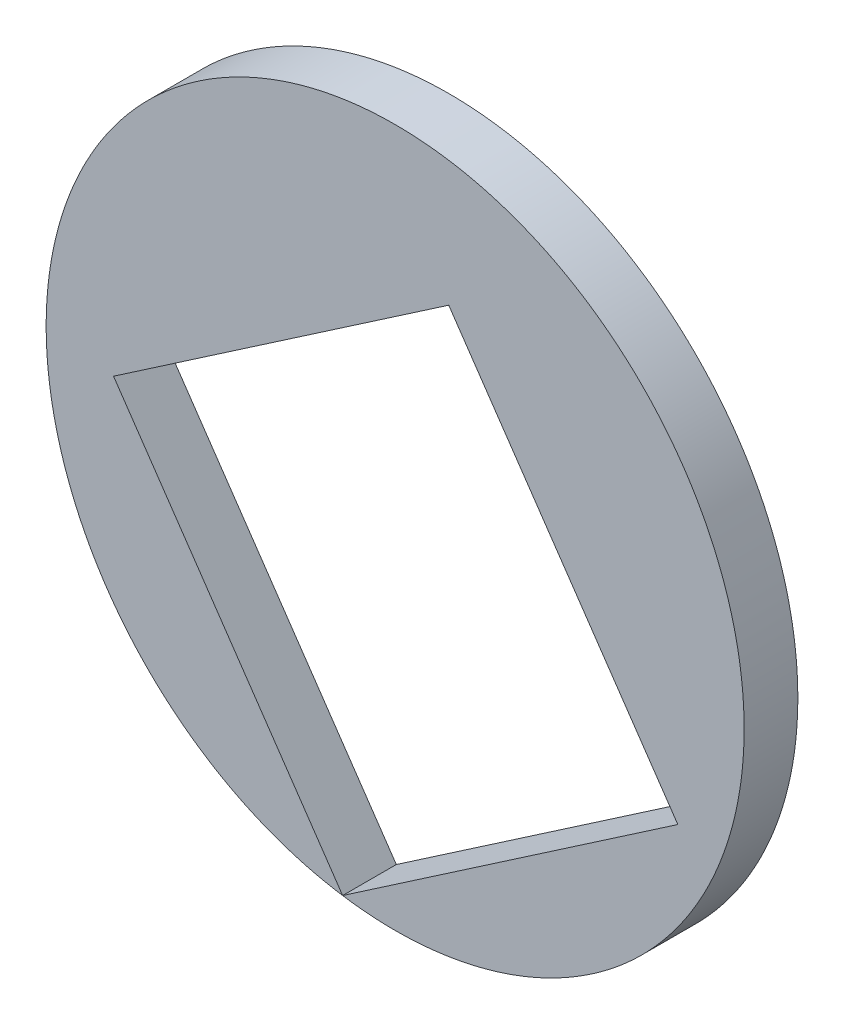
ISO-10303-21;
HEADER;
FILE_DESCRIPTION(('STEP AP214'),'2;1');
FILE_NAME('part.step','',(''),(''),'','','');
FILE_SCHEMA(('AUTOMOTIVE_DESIGN { 1 0 10303 214 1 1 1 1 }'));
ENDSEC;
DATA;
#1=APPLICATION_CONTEXT('core data for automotive mechanical design processes');
#2=APPLICATION_PROTOCOL_DEFINITION('international standard','automotive_design',2000,#1);
#3=PRODUCT_CONTEXT('',#1,'mechanical');
#4=PRODUCT('Part','Part','',(#3));
#5=PRODUCT_RELATED_PRODUCT_CATEGORY('part','',(#4));
#6=PRODUCT_DEFINITION_FORMATION('','',#4);
#7=PRODUCT_DEFINITION_CONTEXT('part definition',#1,'design');
#8=PRODUCT_DEFINITION('design','',#6,#7);
#9=PRODUCT_DEFINITION_SHAPE('','',#8);
#10=(LENGTH_UNIT() NAMED_UNIT(*) SI_UNIT(.MILLI.,.METRE.));
#11=(NAMED_UNIT(*) PLANE_ANGLE_UNIT() SI_UNIT($,.RADIAN.));
#12=(NAMED_UNIT(*) SI_UNIT($,.STERADIAN.) SOLID_ANGLE_UNIT());
#13=UNCERTAINTY_MEASURE_WITH_UNIT(LENGTH_MEASURE(1.E-05),#10,'distance_accuracy_value','');
#14=(GEOMETRIC_REPRESENTATION_CONTEXT(3) GLOBAL_UNCERTAINTY_ASSIGNED_CONTEXT((#13)) GLOBAL_UNIT_ASSIGNED_CONTEXT((#10,
#11,#12)) REPRESENTATION_CONTEXT('',''));
#15=CARTESIAN_POINT('',(0.,0.,0.));
#16=DIRECTION('',(0.,0.,1.));
#17=DIRECTION('',(1.,0.,0.));
#18=AXIS2_PLACEMENT_3D('',#15,#16,#17);
#19=CARTESIAN_POINT('',(0.,0.,1.6));
#20=DIRECTION('',(0.,0.,1.));
#21=DIRECTION('',(1.,0.,0.));
#22=AXIS2_PLACEMENT_3D('',#19,#20,#21);
#23=PLANE('',#22);
#24=CARTESIAN_POINT('',(0.,0.,1.6));
#25=DIRECTION('',(0.,0.,1.));
#26=DIRECTION('',(1.,0.,0.));
#27=AXIS2_PLACEMENT_3D('',#24,#25,#26);
#28=CIRCLE('',#27,10.4);
#29=CARTESIAN_POINT('',(10.4,0.,1.6));
#30=VERTEX_POINT('',#29);
#31=EDGE_CURVE('E11',#30,#30,#28,.T.);
#32=ORIENTED_EDGE('',*,*,#31,.T.);
#33=EDGE_LOOP('',(#32));
#34=FACE_BOUND('',#33,.T.);
#35=DIRECTION('',(-0.825606210754551,-0.564246741030475,0.));
#36=VECTOR('',#35,1.);
#37=CARTESIAN_POINT('',(-8.39263842876766,-0.291291012767298,1.6));
#38=LINE('',#37,#36);
#39=CARTESIAN_POINT('',(1.59719672136241,6.53609455370145,1.6));
#40=VERTEX_POINT('',#39);
#41=CARTESIAN_POINT('',(-8.39263842876766,-0.291291012767298,1.6));
#42=VERTEX_POINT('',#41);
#43=EDGE_CURVE('E82',#40,#42,#38,.T.);
#44=ORIENTED_EDGE('',*,*,#43,.F.);
#45=DIRECTION('',(-0.564246741030475,0.825606210754551,0.));
#46=VECTOR('',#45,1.);
#47=CARTESIAN_POINT('',(8.42458228783116,-3.45374059642861,1.6));
#48=LINE('',#47,#46);
#49=CARTESIAN_POINT('',(8.42458228783116,-3.45374059642861,1.6));
#50=VERTEX_POINT('',#49);
#51=EDGE_CURVE('E74',#50,#40,#48,.T.);
#52=ORIENTED_EDGE('',*,*,#51,.F.);
#53=DIRECTION('',(0.825606210754551,0.564246741030475,0.));
#54=VECTOR('',#53,1.);
#55=CARTESIAN_POINT('',(-1.5652528622989,-10.2811261628974,1.6));
#56=LINE('',#55,#54);
#57=CARTESIAN_POINT('',(-1.5652528622989,-10.2811261628974,1.6));
#58=VERTEX_POINT('',#57);
#59=EDGE_CURVE('E95',#58,#50,#56,.T.);
#60=ORIENTED_EDGE('',*,*,#59,.F.);
#61=DIRECTION('',(0.564246741030475,-0.825606210754551,0.));
#62=VECTOR('',#61,1.);
#63=CARTESIAN_POINT('',(-1.5652528622989,-10.2811261628974,1.6));
#64=LINE('',#63,#62);
#65=EDGE_CURVE('E93',#42,#58,#64,.T.);
#66=ORIENTED_EDGE('',*,*,#65,.F.);
#67=EDGE_LOOP('',(#44,#52,#60,#66));
#68=FACE_BOUND('',#67,.T.);
#69=ADVANCED_FACE('F33',(#34,#68),#23,.T.);
#70=CARTESIAN_POINT('',(0.,0.,0.));
#71=DIRECTION('',(0.,0.,1.));
#72=DIRECTION('',(1.,0.,0.));
#73=AXIS2_PLACEMENT_3D('',#70,#71,#72);
#74=PLANE('',#73);
#75=CARTESIAN_POINT('',(0.,0.,0.));
#76=DIRECTION('',(0.,0.,1.));
#77=DIRECTION('',(1.,0.,0.));
#78=AXIS2_PLACEMENT_3D('',#75,#76,#77);
#79=CIRCLE('',#78,10.4);
#80=CARTESIAN_POINT('',(10.4,0.,0.));
#81=VERTEX_POINT('',#80);
#82=EDGE_CURVE('E37',#81,#81,#79,.T.);
#83=ORIENTED_EDGE('',*,*,#82,.F.);
#84=EDGE_LOOP('',(#83));
#85=FACE_BOUND('',#84,.T.);
#86=DIRECTION('',(-0.564246741030475,0.825606210754551,0.));
#87=VECTOR('',#86,1.);
#88=CARTESIAN_POINT('',(8.42458228783116,-3.45374059642861,0.));
#89=LINE('',#88,#87);
#90=CARTESIAN_POINT('',(8.42458228783116,-3.45374059642862,0.));
#91=VERTEX_POINT('',#90);
#92=CARTESIAN_POINT('',(1.59719672136241,6.53609455370145,0.));
#93=VERTEX_POINT('',#92);
#94=EDGE_CURVE('E56',#91,#93,#89,.T.);
#95=ORIENTED_EDGE('',*,*,#94,.T.);
#96=DIRECTION('',(-0.825606210754551,-0.564246741030475,0.));
#97=VECTOR('',#96,1.);
#98=CARTESIAN_POINT('',(-8.39263842876766,-0.291291012767298,0.));
#99=LINE('',#98,#97);
#100=CARTESIAN_POINT('',(-8.39263842876766,-0.291291012767298,0.));
#101=VERTEX_POINT('',#100);
#102=EDGE_CURVE('E89',#93,#101,#99,.T.);
#103=ORIENTED_EDGE('',*,*,#102,.T.);
#104=DIRECTION('',(0.564246741030475,-0.825606210754551,0.));
#105=VECTOR('',#104,1.);
#106=CARTESIAN_POINT('',(-1.5652528622989,-10.2811261628974,0.));
#107=LINE('',#106,#105);
#108=CARTESIAN_POINT('',(-1.5652528622989,-10.2811261628974,0.));
#109=VERTEX_POINT('',#108);
#110=EDGE_CURVE('E101',#101,#109,#107,.T.);
#111=ORIENTED_EDGE('',*,*,#110,.T.);
#112=DIRECTION('',(0.825606210754551,0.564246741030475,0.));
#113=VECTOR('',#112,1.);
#114=CARTESIAN_POINT('',(-1.5652528622989,-10.2811261628974,0.));
#115=LINE('',#114,#113);
#116=EDGE_CURVE('E83',#109,#91,#115,.T.);
#117=ORIENTED_EDGE('',*,*,#116,.T.);
#118=EDGE_LOOP('',(#95,#103,#111,#117));
#119=FACE_BOUND('',#118,.T.);
#120=ADVANCED_FACE('F112',(#85,#119),#74,.F.);
#121=CARTESIAN_POINT('',(0.,0.,1.6));
#122=DIRECTION('',(0.,0.,-1.));
#123=DIRECTION('',(-1.,0.,0.));
#124=AXIS2_PLACEMENT_3D('',#121,#122,#123);
#125=CYLINDRICAL_SURFACE('',#124,10.4);
#126=ORIENTED_EDGE('',*,*,#31,.F.);
#127=EDGE_LOOP('',(#126));
#128=FACE_BOUND('',#127,.T.);
#129=ORIENTED_EDGE('',*,*,#82,.T.);
#130=EDGE_LOOP('',(#129));
#131=FACE_BOUND('',#130,.T.);
#132=ADVANCED_FACE('F35',(#128,#131),#125,.T.);
#133=CARTESIAN_POINT('',(8.42458228783116,-3.45374059642861,1.6));
#134=DIRECTION('',(-0.825606210754551,-0.564246741030475,0.));
#135=DIRECTION('',(0.564246741030475,-0.825606210754551,0.));
#136=AXIS2_PLACEMENT_3D('',#133,#134,#135);
#137=PLANE('',#136);
#138=ORIENTED_EDGE('',*,*,#94,.F.);
#139=DIRECTION('',(0.,0.,-1.));
#140=VECTOR('',#139,1.);
#141=CARTESIAN_POINT('',(8.42458228783116,-3.45374059642861,1.6));
#142=LINE('',#141,#140);
#143=EDGE_CURVE('E78',#50,#91,#142,.T.);
#144=ORIENTED_EDGE('',*,*,#143,.F.);
#145=ORIENTED_EDGE('',*,*,#51,.T.);
#146=DIRECTION('',(0.,0.,-1.));
#147=VECTOR('',#146,1.);
#148=CARTESIAN_POINT('',(1.59719672136241,6.53609455370145,1.6));
#149=LINE('',#148,#147);
#150=EDGE_CURVE('E77',#40,#93,#149,.T.);
#151=ORIENTED_EDGE('',*,*,#150,.T.);
#152=EDGE_LOOP('',(#138,#144,#145,#151));
#153=FACE_BOUND('',#152,.T.);
#154=ADVANCED_FACE('F76',(#153),#137,.T.);
#155=CARTESIAN_POINT('',(-8.39263842876766,-0.291291012767298,1.6));
#156=DIRECTION('',(0.564246741030475,-0.825606210754551,0.));
#157=DIRECTION('',(0.825606210754551,0.564246741030475,0.));
#158=AXIS2_PLACEMENT_3D('',#155,#156,#157);
#159=PLANE('',#158);
#160=ORIENTED_EDGE('',*,*,#102,.F.);
#161=ORIENTED_EDGE('',*,*,#150,.F.);
#162=ORIENTED_EDGE('',*,*,#43,.T.);
#163=DIRECTION('',(0.,0.,-1.));
#164=VECTOR('',#163,1.);
#165=CARTESIAN_POINT('',(-8.39263842876766,-0.291291012767298,1.6));
#166=LINE('',#165,#164);
#167=EDGE_CURVE('E90',#42,#101,#166,.T.);
#168=ORIENTED_EDGE('',*,*,#167,.T.);
#169=EDGE_LOOP('',(#160,#161,#162,#168));
#170=FACE_BOUND('',#169,.T.);
#171=ADVANCED_FACE('F86',(#170),#159,.T.);
#172=CARTESIAN_POINT('',(-1.5652528622989,-10.2811261628974,1.6));
#173=DIRECTION('',(0.825606210754551,0.564246741030475,0.));
#174=DIRECTION('',(-0.564246741030475,0.825606210754551,0.));
#175=AXIS2_PLACEMENT_3D('',#172,#173,#174);
#176=PLANE('',#175);
#177=ORIENTED_EDGE('',*,*,#110,.F.);
#178=ORIENTED_EDGE('',*,*,#167,.F.);
#179=ORIENTED_EDGE('',*,*,#65,.T.);
#180=DIRECTION('',(0.,0.,-1.));
#181=VECTOR('',#180,1.);
#182=CARTESIAN_POINT('',(-1.5652528622989,-10.2811261628974,1.6));
#183=LINE('',#182,#181);
#184=EDGE_CURVE('E48',#58,#109,#183,.T.);
#185=ORIENTED_EDGE('',*,*,#184,.T.);
#186=EDGE_LOOP('',(#177,#178,#179,#185));
#187=FACE_BOUND('',#186,.T.);
#188=ADVANCED_FACE('F110',(#187),#176,.T.);
#189=CARTESIAN_POINT('',(-1.5652528622989,-10.2811261628974,1.6));
#190=DIRECTION('',(-0.564246741030475,0.825606210754551,0.));
#191=DIRECTION('',(-0.825606210754551,-0.564246741030475,0.));
#192=AXIS2_PLACEMENT_3D('',#189,#190,#191);
#193=PLANE('',#192);
#194=ORIENTED_EDGE('',*,*,#116,.F.);
#195=ORIENTED_EDGE('',*,*,#184,.F.);
#196=ORIENTED_EDGE('',*,*,#59,.T.);
#197=ORIENTED_EDGE('',*,*,#143,.T.);
#198=EDGE_LOOP('',(#194,#195,#196,#197));
#199=FACE_BOUND('',#198,.T.);
#200=ADVANCED_FACE('F113',(#199),#193,.T.);
#201=CLOSED_SHELL('',(#69,#120,#132,#154,#171,#188,#200));
#202=MANIFOLD_SOLID_BREP('B2',#201);
#203=ADVANCED_BREP_SHAPE_REPRESENTATION('',(#18,#202),#14);
#204=SHAPE_DEFINITION_REPRESENTATION(#9,#203);
ENDSEC;
END-ISO-10303-21;
